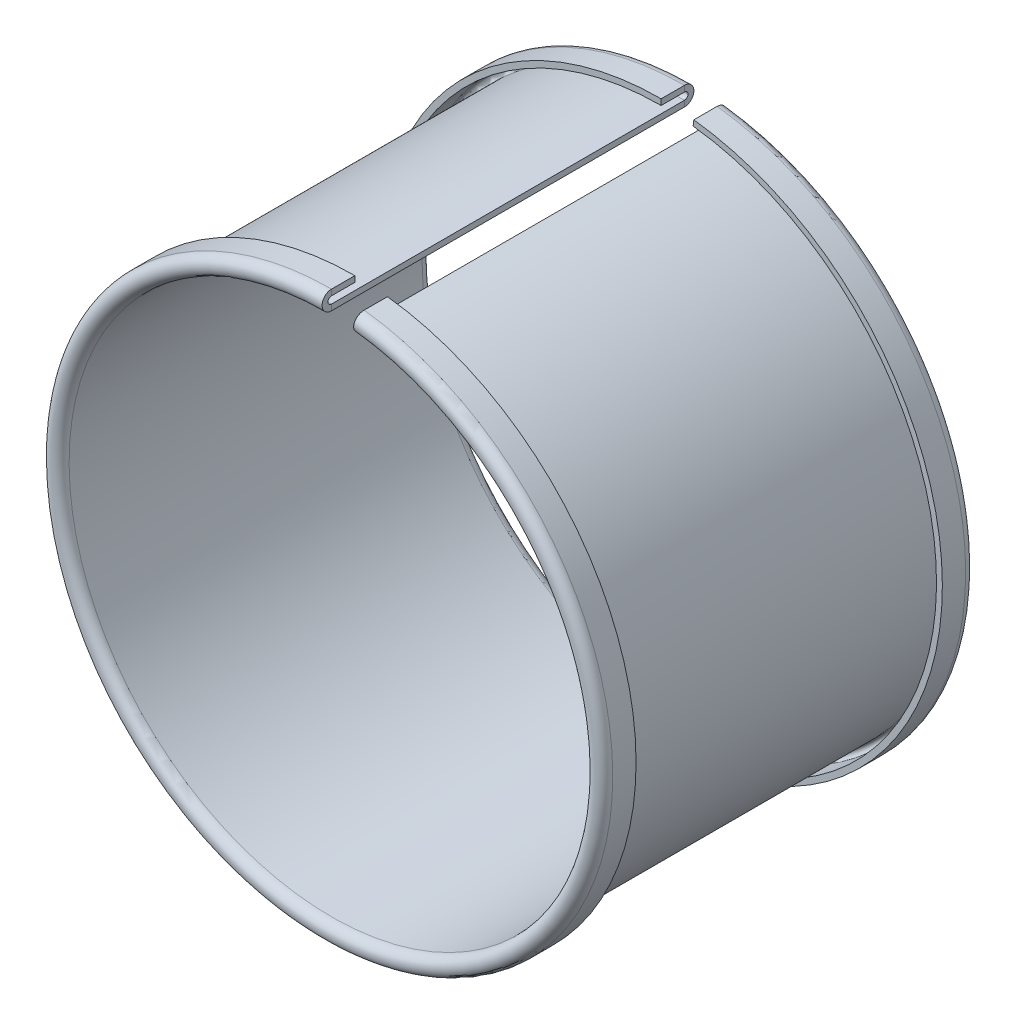
ISO-10303-21;
HEADER;
FILE_DESCRIPTION(('STEP AP214'),'2;1');
FILE_NAME('part.step','',(''),(''),'','','');
FILE_SCHEMA(('AUTOMOTIVE_DESIGN { 1 0 10303 214 1 1 1 1 }'));
ENDSEC;
DATA;
#1=APPLICATION_CONTEXT('core data for automotive mechanical design processes');
#2=APPLICATION_PROTOCOL_DEFINITION('international standard','automotive_design',2000,#1);
#3=PRODUCT_CONTEXT('',#1,'mechanical');
#4=PRODUCT('Part','Part','',(#3));
#5=PRODUCT_RELATED_PRODUCT_CATEGORY('part','',(#4));
#6=PRODUCT_DEFINITION_FORMATION('','',#4);
#7=PRODUCT_DEFINITION_CONTEXT('part definition',#1,'design');
#8=PRODUCT_DEFINITION('design','',#6,#7);
#9=PRODUCT_DEFINITION_SHAPE('','',#8);
#10=(LENGTH_UNIT() NAMED_UNIT(*) SI_UNIT(.MILLI.,.METRE.));
#11=(NAMED_UNIT(*) PLANE_ANGLE_UNIT() SI_UNIT($,.RADIAN.));
#12=(NAMED_UNIT(*) SI_UNIT($,.STERADIAN.) SOLID_ANGLE_UNIT());
#13=UNCERTAINTY_MEASURE_WITH_UNIT(LENGTH_MEASURE(1.E-05),#10,'distance_accuracy_value','');
#14=(GEOMETRIC_REPRESENTATION_CONTEXT(3) GLOBAL_UNCERTAINTY_ASSIGNED_CONTEXT((#13)) GLOBAL_UNIT_ASSIGNED_CONTEXT((#10,
#11,#12)) REPRESENTATION_CONTEXT('',''));
#15=CARTESIAN_POINT('',(0.,0.,0.));
#16=DIRECTION('',(0.,0.,1.));
#17=DIRECTION('',(1.,0.,0.));
#18=AXIS2_PLACEMENT_3D('',#15,#16,#17);
#19=CARTESIAN_POINT('',(5.40328216932433,46.229164912521,-60.4348691586507));
#20=DIRECTION('',(-0.993238685395127,0.116090110838776,0.));
#21=DIRECTION('',(-0.116090110838776,-0.993238685395127,0.));
#22=AXIS2_PLACEMENT_3D('',#19,#20,#21);
#23=PLANE('',#22);
#24=DIRECTION('',(-0.116090110838776,-0.993238685395127,0.));
#25=VECTOR('',#24,1.);
#26=CARTESIAN_POINT('',(5.59004213233672,47.8270376236985,-60.4348691586507));
#27=LINE('',#26,#25);
#28=CARTESIAN_POINT('',(5.59004213233672,47.8270376236985,-60.4348691586507));
#29=VERTEX_POINT('',#28);
#30=CARTESIAN_POINT('',(5.47395202149794,46.8337989383033,-60.4348691586507));
#31=VERTEX_POINT('',#30);
#32=EDGE_CURVE('E11',#29,#31,#27,.T.);
#33=ORIENTED_EDGE('',*,*,#32,.F.);
#34=CARTESIAN_POINT('',(5.40328216932433,46.229164912521,-60.4348691586507));
#35=DIRECTION('',(0.993238685395127,-0.116090110838776,0.));
#36=DIRECTION('',(0.,0.,-1.));
#37=AXIS2_PLACEMENT_3D('',#34,#35,#36);
#38=CIRCLE('',#37,1.60874997588503);
#39=CARTESIAN_POINT('',(5.21652220631197,44.6312922013435,-60.4348691586507));
#40=VERTEX_POINT('',#39);
#41=EDGE_CURVE('E160',#40,#29,#38,.T.);
#42=ORIENTED_EDGE('',*,*,#41,.F.);
#43=DIRECTION('',(0.116090110838777,0.993238685395127,0.));
#44=VECTOR('',#43,1.);
#45=CARTESIAN_POINT('',(5.21652220631197,44.6312922013435,-60.4348691586507));
#46=LINE('',#45,#44);
#47=CARTESIAN_POINT('',(5.33261231715075,45.6245308867386,-60.4348691586507));
#48=VERTEX_POINT('',#47);
#49=EDGE_CURVE('E49',#40,#48,#46,.T.);
#50=ORIENTED_EDGE('',*,*,#49,.T.);
#51=CARTESIAN_POINT('',(5.40328216932434,46.229164912521,-60.4348691586507));
#52=DIRECTION('',(0.993238685395127,-0.116090110838776,0.));
#53=DIRECTION('',(0.116090110838776,0.993238685395127,0.));
#54=AXIS2_PLACEMENT_3D('',#51,#52,#53);
#55=CIRCLE('',#54,0.608749975885032);
#56=EDGE_CURVE('E157',#48,#31,#55,.T.);
#57=ORIENTED_EDGE('',*,*,#56,.T.);
#58=EDGE_LOOP('',(#33,#42,#50,#57));
#59=FACE_BOUND('',#58,.T.);
#60=ADVANCED_FACE('F39',(#59),#23,.T.);
#61=CARTESIAN_POINT('',(5.21652220631196,44.6312922013435,-30.2174345793254));
#62=DIRECTION('',(0.993238685395127,-0.116090110838776,0.));
#63=DIRECTION('',(0.,0.,-1.));
#64=AXIS2_PLACEMENT_3D('',#61,#62,#63);
#65=PLANE('',#64);
#66=ORIENTED_EDGE('',*,*,#49,.F.);
#67=DIRECTION('',(0.,0.,-1.));
#68=VECTOR('',#67,1.);
#69=CARTESIAN_POINT('',(5.21652220631196,44.6312922013435,0.));
#70=LINE('',#69,#68);
#71=CARTESIAN_POINT('',(5.21652220631197,44.6312922013435,0.));
#72=VERTEX_POINT('',#71);
#73=EDGE_CURVE('E236',#72,#40,#70,.T.);
#74=ORIENTED_EDGE('',*,*,#73,.F.);
#75=DIRECTION('',(0.116090110838776,0.993238685395127,0.));
#76=VECTOR('',#75,1.);
#77=CARTESIAN_POINT('',(5.21652220631197,44.6312922013435,0.));
#78=LINE('',#77,#76);
#79=CARTESIAN_POINT('',(5.33261231715075,45.6245308867386,0.));
#80=VERTEX_POINT('',#79);
#81=EDGE_CURVE('E149',#72,#80,#78,.T.);
#82=ORIENTED_EDGE('',*,*,#81,.T.);
#83=DIRECTION('',(0.,0.,1.));
#84=VECTOR('',#83,1.);
#85=CARTESIAN_POINT('',(5.33261231715074,45.6245308867386,0.));
#86=LINE('',#85,#84);
#87=EDGE_CURVE('E177',#80,#48,#86,.F.);
#88=ORIENTED_EDGE('',*,*,#87,.T.);
#89=EDGE_LOOP('',(#66,#74,#82,#88));
#90=FACE_BOUND('',#89,.T.);
#91=ADVANCED_FACE('F178',(#90),#65,.F.);
#92=CARTESIAN_POINT('',(5.40328216932433,46.229164912521,0.));
#93=DIRECTION('',(-0.993238685395127,0.116090110838776,0.));
#94=DIRECTION('',(-0.116090110838776,-0.993238685395127,0.));
#95=AXIS2_PLACEMENT_3D('',#92,#93,#94);
#96=PLANE('',#95);
#97=ORIENTED_EDGE('',*,*,#81,.F.);
#98=CARTESIAN_POINT('',(5.40328216932433,46.229164912521,0.));
#99=DIRECTION('',(0.993238685395127,-0.116090110838776,0.));
#100=DIRECTION('',(0.,0.,1.));
#101=AXIS2_PLACEMENT_3D('',#98,#99,#100);
#102=CIRCLE('',#101,1.60874997588503);
#103=CARTESIAN_POINT('',(5.59004213233672,47.8270376236985,0.));
#104=VERTEX_POINT('',#103);
#105=EDGE_CURVE('E225',#104,#72,#102,.T.);
#106=ORIENTED_EDGE('',*,*,#105,.F.);
#107=DIRECTION('',(-0.116090110838777,-0.993238685395127,0.));
#108=VECTOR('',#107,1.);
#109=CARTESIAN_POINT('',(5.59004213233672,47.8270376236985,0.));
#110=LINE('',#109,#108);
#111=CARTESIAN_POINT('',(5.47395202149794,46.8337989383033,0.));
#112=VERTEX_POINT('',#111);
#113=EDGE_CURVE('E146',#104,#112,#110,.T.);
#114=ORIENTED_EDGE('',*,*,#113,.T.);
#115=CARTESIAN_POINT('',(5.40328216932434,46.229164912521,0.));
#116=DIRECTION('',(0.993238685395127,-0.116090110838776,0.));
#117=DIRECTION('',(0.116090110838776,0.993238685395127,0.));
#118=AXIS2_PLACEMENT_3D('',#115,#116,#117);
#119=CIRCLE('',#118,0.608749975885032);
#120=EDGE_CURVE('E194',#112,#80,#119,.T.);
#121=ORIENTED_EDGE('',*,*,#120,.T.);
#122=EDGE_LOOP('',(#97,#106,#114,#121));
#123=FACE_BOUND('',#122,.T.);
#124=ADVANCED_FACE('F268',(#123),#96,.T.);
#125=CARTESIAN_POINT('',(5.59004213233671,47.8270376236985,-1.99664372414659));
#126=DIRECTION('',(-0.993238685395127,0.116090110838776,0.));
#127=DIRECTION('',(0.,0.,1.));
#128=AXIS2_PLACEMENT_3D('',#125,#126,#127);
#129=PLANE('',#128);
#130=ORIENTED_EDGE('',*,*,#113,.F.);
#131=DIRECTION('',(0.,0.,1.));
#132=VECTOR('',#131,1.);
#133=CARTESIAN_POINT('',(5.59004213233671,47.8270376236985,0.));
#134=LINE('',#133,#132);
#135=CARTESIAN_POINT('',(5.59004213233672,47.8270376236985,-3.99328744829317));
#136=VERTEX_POINT('',#135);
#137=EDGE_CURVE('E219',#136,#104,#134,.T.);
#138=ORIENTED_EDGE('',*,*,#137,.F.);
#139=DIRECTION('',(-0.116090110838777,-0.993238685395127,0.));
#140=VECTOR('',#139,1.);
#141=CARTESIAN_POINT('',(5.59004213233672,47.8270376236985,-3.99328744829317));
#142=LINE('',#141,#140);
#143=CARTESIAN_POINT('',(5.47395202149794,46.8337989383033,-3.99328744829317));
#144=VERTEX_POINT('',#143);
#145=EDGE_CURVE('E143',#136,#144,#142,.T.);
#146=ORIENTED_EDGE('',*,*,#145,.T.);
#147=DIRECTION('',(0.,0.,1.));
#148=VECTOR('',#147,1.);
#149=CARTESIAN_POINT('',(5.47395202149793,46.8337989383033,0.));
#150=LINE('',#149,#148);
#151=EDGE_CURVE('E198',#144,#112,#150,.T.);
#152=ORIENTED_EDGE('',*,*,#151,.T.);
#153=EDGE_LOOP('',(#130,#138,#146,#152));
#154=FACE_BOUND('',#153,.T.);
#155=ADVANCED_FACE('F275',(#154),#129,.T.);
#156=CARTESIAN_POINT('',(0.,0.,-3.99328744829317));
#157=DIRECTION('',(0.,0.,-1.));
#158=DIRECTION('',(-1.,0.,0.));
#159=AXIS2_PLACEMENT_3D('',#156,#157,#158);
#160=PLANE('',#159);
#161=ORIENTED_EDGE('',*,*,#145,.F.);
#162=CARTESIAN_POINT('',(0.,0.,-3.99328744829317));
#163=DIRECTION('',(0.,0.,1.));
#164=DIRECTION('',(0.,1.,0.));
#165=AXIS2_PLACEMENT_3D('',#162,#163,#164);
#166=CIRCLE('',#165,48.152612586442);
#167=CARTESIAN_POINT('',(0.,48.152612586442,-3.99328744829317));
#168=VERTEX_POINT('',#167);
#169=EDGE_CURVE('E115',#168,#136,#166,.T.);
#170=ORIENTED_EDGE('',*,*,#169,.F.);
#171=DIRECTION('',(0.,-1.,0.));
#172=VECTOR('',#171,1.);
#173=CARTESIAN_POINT('',(0.,48.152612586442,-3.99328744829317));
#174=LINE('',#173,#172);
#175=CARTESIAN_POINT('',(0.,47.152612586442,-3.99328744829317));
#176=VERTEX_POINT('',#175);
#177=EDGE_CURVE('E140',#168,#176,#174,.T.);
#178=ORIENTED_EDGE('',*,*,#177,.T.);
#179=CARTESIAN_POINT('',(0.,0.,-3.99328744829317));
#180=DIRECTION('',(0.,0.,1.));
#181=DIRECTION('',(1.,0.,0.));
#182=AXIS2_PLACEMENT_3D('',#179,#180,#181);
#183=CIRCLE('',#182,47.152612586442);
#184=EDGE_CURVE('E203',#176,#144,#183,.T.);
#185=ORIENTED_EDGE('',*,*,#184,.T.);
#186=EDGE_LOOP('',(#161,#170,#178,#185));
#187=FACE_BOUND('',#186,.T.);
#188=ADVANCED_FACE('F300',(#187),#160,.T.);
#189=CARTESIAN_POINT('',(0.,48.152612586442,-1.99664372414659));
#190=DIRECTION('',(-1.,0.,0.));
#191=DIRECTION('',(0.,0.,1.));
#192=AXIS2_PLACEMENT_3D('',#189,#190,#191);
#193=PLANE('',#192);
#194=ORIENTED_EDGE('',*,*,#177,.F.);
#195=DIRECTION('',(0.,0.,1.));
#196=VECTOR('',#195,1.);
#197=CARTESIAN_POINT('',(0.,48.152612586442,0.));
#198=LINE('',#197,#196);
#199=CARTESIAN_POINT('',(0.,48.152612586442,0.));
#200=VERTEX_POINT('',#199);
#201=EDGE_CURVE('E215',#168,#200,#198,.T.);
#202=ORIENTED_EDGE('',*,*,#201,.T.);
#203=DIRECTION('',(0.,-1.,0.));
#204=VECTOR('',#203,1.);
#205=CARTESIAN_POINT('',(0.,48.152612586442,0.));
#206=LINE('',#205,#204);
#207=CARTESIAN_POINT('',(0.,47.152612586442,0.));
#208=VERTEX_POINT('',#207);
#209=EDGE_CURVE('E137',#200,#208,#206,.T.);
#210=ORIENTED_EDGE('',*,*,#209,.T.);
#211=DIRECTION('',(0.,0.,1.));
#212=VECTOR('',#211,1.);
#213=CARTESIAN_POINT('',(0.,47.152612586442,0.));
#214=LINE('',#213,#212);
#215=EDGE_CURVE('E122',#176,#208,#214,.T.);
#216=ORIENTED_EDGE('',*,*,#215,.F.);
#217=EDGE_LOOP('',(#194,#202,#210,#216));
#218=FACE_BOUND('',#217,.T.);
#219=ADVANCED_FACE('F302',(#218),#193,.F.);
#220=CARTESIAN_POINT('',(0.,46.5438626105569,0.));
#221=DIRECTION('',(-1.,0.,0.));
#222=DIRECTION('',(0.,0.,1.));
#223=AXIS2_PLACEMENT_3D('',#220,#221,#222);
#224=PLANE('',#223);
#225=ORIENTED_EDGE('',*,*,#209,.F.);
#226=CARTESIAN_POINT('',(0.,46.5438626105569,0.));
#227=DIRECTION('',(1.,0.,0.));
#228=DIRECTION('',(0.,0.,1.));
#229=AXIS2_PLACEMENT_3D('',#226,#227,#228);
#230=CIRCLE('',#229,1.60874997588503);
#231=CARTESIAN_POINT('',(0.,44.9351126346719,0.));
#232=VERTEX_POINT('',#231);
#233=EDGE_CURVE('E218',#200,#232,#230,.T.);
#234=ORIENTED_EDGE('',*,*,#233,.T.);
#235=DIRECTION('',(0.,1.,0.));
#236=VECTOR('',#235,1.);
#237=CARTESIAN_POINT('',(0.,44.9351126346719,0.));
#238=LINE('',#237,#236);
#239=CARTESIAN_POINT('',(0.,45.9351126346719,0.));
#240=VERTEX_POINT('',#239);
#241=EDGE_CURVE('E134',#232,#240,#238,.T.);
#242=ORIENTED_EDGE('',*,*,#241,.T.);
#243=CARTESIAN_POINT('',(0.,46.5438626105569,0.));
#244=DIRECTION('',(1.,0.,0.));
#245=DIRECTION('',(0.,1.,0.));
#246=AXIS2_PLACEMENT_3D('',#243,#244,#245);
#247=CIRCLE('',#246,0.608749975885032);
#248=EDGE_CURVE('E125',#208,#240,#247,.T.);
#249=ORIENTED_EDGE('',*,*,#248,.F.);
#250=EDGE_LOOP('',(#225,#234,#242,#249));
#251=FACE_BOUND('',#250,.T.);
#252=ADVANCED_FACE('F282',(#251),#224,.F.);
#253=CARTESIAN_POINT('',(0.,44.9351126346719,-30.2174345793254));
#254=DIRECTION('',(1.,0.,0.));
#255=DIRECTION('',(0.,0.,-1.));
#256=AXIS2_PLACEMENT_3D('',#253,#254,#255);
#257=PLANE('',#256);
#258=ORIENTED_EDGE('',*,*,#241,.F.);
#259=DIRECTION('',(0.,0.,-1.));
#260=VECTOR('',#259,1.);
#261=CARTESIAN_POINT('',(0.,44.9351126346719,0.));
#262=LINE('',#261,#260);
#263=CARTESIAN_POINT('',(0.,44.9351126346719,-60.4348691586507));
#264=VERTEX_POINT('',#263);
#265=EDGE_CURVE('E230',#232,#264,#262,.T.);
#266=ORIENTED_EDGE('',*,*,#265,.T.);
#267=DIRECTION('',(0.,1.,0.));
#268=VECTOR('',#267,1.);
#269=CARTESIAN_POINT('',(0.,44.9351126346719,-60.4348691586507));
#270=LINE('',#269,#268);
#271=CARTESIAN_POINT('',(0.,45.9351126346719,-60.4348691586507));
#272=VERTEX_POINT('',#271);
#273=EDGE_CURVE('E131',#264,#272,#270,.T.);
#274=ORIENTED_EDGE('',*,*,#273,.T.);
#275=DIRECTION('',(0.,0.,1.));
#276=VECTOR('',#275,1.);
#277=CARTESIAN_POINT('',(0.,45.9351126346719,0.));
#278=LINE('',#277,#276);
#279=EDGE_CURVE('E187',#240,#272,#278,.F.);
#280=ORIENTED_EDGE('',*,*,#279,.F.);
#281=EDGE_LOOP('',(#258,#266,#274,#280));
#282=FACE_BOUND('',#281,.T.);
#283=ADVANCED_FACE('F285',(#282),#257,.T.);
#284=CARTESIAN_POINT('',(0.,46.5438626105569,-60.4348691586507));
#285=DIRECTION('',(-1.,0.,0.));
#286=DIRECTION('',(0.,0.,1.));
#287=AXIS2_PLACEMENT_3D('',#284,#285,#286);
#288=PLANE('',#287);
#289=ORIENTED_EDGE('',*,*,#273,.F.);
#290=CARTESIAN_POINT('',(0.,46.5438626105569,-60.4348691586507));
#291=DIRECTION('',(1.,0.,0.));
#292=DIRECTION('',(0.,0.,-1.));
#293=AXIS2_PLACEMENT_3D('',#290,#291,#292);
#294=CIRCLE('',#293,1.60874997588503);
#295=CARTESIAN_POINT('',(0.,48.152612586442,-60.4348691586507));
#296=VERTEX_POINT('',#295);
#297=EDGE_CURVE('E116',#264,#296,#294,.T.);
#298=ORIENTED_EDGE('',*,*,#297,.T.);
#299=DIRECTION('',(0.,-1.,0.));
#300=VECTOR('',#299,1.);
#301=CARTESIAN_POINT('',(0.,48.152612586442,-60.4348691586507));
#302=LINE('',#301,#300);
#303=CARTESIAN_POINT('',(0.,47.152612586442,-60.4348691586507));
#304=VERTEX_POINT('',#303);
#305=EDGE_CURVE('E105',#296,#304,#302,.T.);
#306=ORIENTED_EDGE('',*,*,#305,.T.);
#307=CARTESIAN_POINT('',(0.,46.5438626105569,-60.4348691586507));
#308=DIRECTION('',(1.,0.,0.));
#309=DIRECTION('',(0.,1.,0.));
#310=AXIS2_PLACEMENT_3D('',#307,#308,#309);
#311=CIRCLE('',#310,0.608749975885032);
#312=EDGE_CURVE('E204',#272,#304,#311,.T.);
#313=ORIENTED_EDGE('',*,*,#312,.F.);
#314=EDGE_LOOP('',(#289,#298,#306,#313));
#315=FACE_BOUND('',#314,.T.);
#316=ADVANCED_FACE('F291',(#315),#288,.F.);
#317=CARTESIAN_POINT('',(0.,48.152612586442,-58.4382254345042));
#318=DIRECTION('',(-1.,0.,0.));
#319=DIRECTION('',(0.,0.,1.));
#320=AXIS2_PLACEMENT_3D('',#317,#318,#319);
#321=PLANE('',#320);
#322=ORIENTED_EDGE('',*,*,#305,.F.);
#323=DIRECTION('',(0.,0.,1.));
#324=VECTOR('',#323,1.);
#325=CARTESIAN_POINT('',(0.,48.152612586442,-60.4348691586507));
#326=LINE('',#325,#324);
#327=CARTESIAN_POINT('',(0.,48.152612586442,-56.4415817103576));
#328=VERTEX_POINT('',#327);
#329=EDGE_CURVE('E108',#296,#328,#326,.T.);
#330=ORIENTED_EDGE('',*,*,#329,.T.);
#331=DIRECTION('',(0.,-1.,0.));
#332=VECTOR('',#331,1.);
#333=CARTESIAN_POINT('',(0.,48.152612586442,-56.4415817103576));
#334=LINE('',#333,#332);
#335=CARTESIAN_POINT('',(0.,47.152612586442,-56.4415817103576));
#336=VERTEX_POINT('',#335);
#337=EDGE_CURVE('E94',#328,#336,#334,.T.);
#338=ORIENTED_EDGE('',*,*,#337,.T.);
#339=DIRECTION('',(0.,0.,1.));
#340=VECTOR('',#339,1.);
#341=CARTESIAN_POINT('',(0.,47.152612586442,0.));
#342=LINE('',#341,#340);
#343=EDGE_CURVE('E201',#304,#336,#342,.T.);
#344=ORIENTED_EDGE('',*,*,#343,.F.);
#345=EDGE_LOOP('',(#322,#330,#338,#344));
#346=FACE_BOUND('',#345,.T.);
#347=ADVANCED_FACE('F109',(#346),#321,.F.);
#348=CARTESIAN_POINT('',(0.,0.,-56.4415817103576));
#349=DIRECTION('',(0.,0.,-1.));
#350=DIRECTION('',(-1.,0.,0.));
#351=AXIS2_PLACEMENT_3D('',#348,#349,#350);
#352=PLANE('',#351);
#353=ORIENTED_EDGE('',*,*,#337,.F.);
#354=CARTESIAN_POINT('',(0.,0.,-56.4415817103576));
#355=DIRECTION('',(0.,0.,1.));
#356=DIRECTION('',(0.,1.,0.));
#357=AXIS2_PLACEMENT_3D('',#354,#355,#356);
#358=CIRCLE('',#357,48.152612586442);
#359=CARTESIAN_POINT('',(5.59004213233672,47.8270376236985,-56.4415817103576));
#360=VERTEX_POINT('',#359);
#361=EDGE_CURVE('E98',#328,#360,#358,.T.);
#362=ORIENTED_EDGE('',*,*,#361,.T.);
#363=DIRECTION('',(-0.116090110838777,-0.993238685395127,0.));
#364=VECTOR('',#363,1.);
#365=CARTESIAN_POINT('',(5.59004213233672,47.8270376236985,-56.4415817103576));
#366=LINE('',#365,#364);
#367=CARTESIAN_POINT('',(5.47395202149794,46.8337989383033,-56.4415817103576));
#368=VERTEX_POINT('',#367);
#369=EDGE_CURVE('E43',#360,#368,#366,.T.);
#370=ORIENTED_EDGE('',*,*,#369,.T.);
#371=CARTESIAN_POINT('',(0.,0.,-56.4415817103576));
#372=DIRECTION('',(0.,0.,1.));
#373=DIRECTION('',(1.,0.,0.));
#374=AXIS2_PLACEMENT_3D('',#371,#372,#373);
#375=CIRCLE('',#374,47.152612586442);
#376=EDGE_CURVE('E101',#336,#368,#375,.T.);
#377=ORIENTED_EDGE('',*,*,#376,.F.);
#378=EDGE_LOOP('',(#353,#362,#370,#377));
#379=FACE_BOUND('',#378,.T.);
#380=ADVANCED_FACE('F96',(#379),#352,.F.);
#381=CARTESIAN_POINT('',(5.59004213233671,47.8270376236985,-58.4382254345042));
#382=DIRECTION('',(-0.993238685395127,0.116090110838776,0.));
#383=DIRECTION('',(0.,0.,1.));
#384=AXIS2_PLACEMENT_3D('',#381,#382,#383);
#385=PLANE('',#384);
#386=DIRECTION('',(0.,0.,1.));
#387=VECTOR('',#386,1.);
#388=CARTESIAN_POINT('',(5.59004213233671,47.8270376236985,-60.4348691586507));
#389=LINE('',#388,#387);
#390=EDGE_CURVE('E121',#29,#360,#389,.T.);
#391=ORIENTED_EDGE('',*,*,#390,.F.);
#392=ORIENTED_EDGE('',*,*,#32,.T.);
#393=DIRECTION('',(0.,0.,1.));
#394=VECTOR('',#393,1.);
#395=CARTESIAN_POINT('',(5.47395202149793,46.8337989383033,0.));
#396=LINE('',#395,#394);
#397=EDGE_CURVE('E200',#31,#368,#396,.T.);
#398=ORIENTED_EDGE('',*,*,#397,.T.);
#399=ORIENTED_EDGE('',*,*,#369,.F.);
#400=EDGE_LOOP('',(#391,#392,#398,#399));
#401=FACE_BOUND('',#400,.T.);
#402=ADVANCED_FACE('F41',(#401),#385,.T.);
#403=CARTESIAN_POINT('',(0.,0.,0.));
#404=DIRECTION('',(0.,0.,1.));
#405=DIRECTION('',(1.,0.,0.));
#406=AXIS2_PLACEMENT_3D('',#403,#404,#405);
#407=CYLINDRICAL_SURFACE('',#406,47.152612586442);
#408=ORIENTED_EDGE('',*,*,#376,.T.);
#409=ORIENTED_EDGE('',*,*,#397,.F.);
#410=CARTESIAN_POINT('',(0.,0.,-60.4348691586507));
#411=DIRECTION('',(0.,0.,1.));
#412=DIRECTION('',(1.,0.,0.));
#413=AXIS2_PLACEMENT_3D('',#410,#411,#412);
#414=CIRCLE('',#413,47.152612586442);
#415=EDGE_CURVE('E174',#304,#31,#414,.T.);
#416=ORIENTED_EDGE('',*,*,#415,.F.);
#417=ORIENTED_EDGE('',*,*,#343,.T.);
#418=EDGE_LOOP('',(#408,#409,#416,#417));
#419=FACE_BOUND('',#418,.T.);
#420=ADVANCED_FACE('F392',(#419),#407,.F.);
#421=CARTESIAN_POINT('',(0.,0.,-60.4348691586507));
#422=DIRECTION('',(0.,0.,1.));
#423=DIRECTION('',(1.,0.,0.));
#424=AXIS2_PLACEMENT_3D('',#421,#422,#423);
#425=TOROIDAL_SURFACE('',#424,46.5438626105569,0.608749975885032);
#426=ORIENTED_EDGE('',*,*,#415,.T.);
#427=ORIENTED_EDGE('',*,*,#56,.F.);
#428=CARTESIAN_POINT('',(0.,0.,-60.4348691586507));
#429=DIRECTION('',(0.,0.,1.));
#430=DIRECTION('',(1.,0.,0.));
#431=AXIS2_PLACEMENT_3D('',#428,#429,#430);
#432=CIRCLE('',#431,45.9351126346719);
#433=EDGE_CURVE('E172',#272,#48,#432,.T.);
#434=ORIENTED_EDGE('',*,*,#433,.F.);
#435=ORIENTED_EDGE('',*,*,#312,.T.);
#436=EDGE_LOOP('',(#426,#427,#434,#435));
#437=FACE_BOUND('',#436,.T.);
#438=ADVANCED_FACE('F168',(#437),#425,.F.);
#439=CARTESIAN_POINT('',(0.,0.,0.));
#440=DIRECTION('',(0.,0.,1.));
#441=DIRECTION('',(1.,0.,0.));
#442=AXIS2_PLACEMENT_3D('',#439,#440,#441);
#443=CYLINDRICAL_SURFACE('',#442,45.9351126346719);
#444=ORIENTED_EDGE('',*,*,#433,.T.);
#445=ORIENTED_EDGE('',*,*,#87,.F.);
#446=CARTESIAN_POINT('',(0.,0.,0.));
#447=DIRECTION('',(0.,0.,1.));
#448=DIRECTION('',(1.,0.,0.));
#449=AXIS2_PLACEMENT_3D('',#446,#447,#448);
#450=CIRCLE('',#449,45.9351126346719);
#451=EDGE_CURVE('E182',#240,#80,#450,.T.);
#452=ORIENTED_EDGE('',*,*,#451,.F.);
#453=ORIENTED_EDGE('',*,*,#279,.T.);
#454=EDGE_LOOP('',(#444,#445,#452,#453));
#455=FACE_BOUND('',#454,.T.);
#456=ADVANCED_FACE('F185',(#455),#443,.T.);
#457=CARTESIAN_POINT('',(0.,0.,0.));
#458=DIRECTION('',(0.,0.,1.));
#459=DIRECTION('',(1.,0.,0.));
#460=AXIS2_PLACEMENT_3D('',#457,#458,#459);
#461=TOROIDAL_SURFACE('',#460,46.5438626105569,0.608749975885032);
#462=ORIENTED_EDGE('',*,*,#451,.T.);
#463=ORIENTED_EDGE('',*,*,#120,.F.);
#464=CARTESIAN_POINT('',(0.,0.,0.));
#465=DIRECTION('',(0.,0.,1.));
#466=DIRECTION('',(1.,0.,0.));
#467=AXIS2_PLACEMENT_3D('',#464,#465,#466);
#468=CIRCLE('',#467,47.152612586442);
#469=EDGE_CURVE('E195',#208,#112,#468,.T.);
#470=ORIENTED_EDGE('',*,*,#469,.F.);
#471=ORIENTED_EDGE('',*,*,#248,.T.);
#472=EDGE_LOOP('',(#462,#463,#470,#471));
#473=FACE_BOUND('',#472,.T.);
#474=ADVANCED_FACE('F273',(#473),#461,.F.);
#475=CARTESIAN_POINT('',(0.,0.,0.));
#476=DIRECTION('',(0.,0.,1.));
#477=DIRECTION('',(1.,0.,0.));
#478=AXIS2_PLACEMENT_3D('',#475,#476,#477);
#479=CYLINDRICAL_SURFACE('',#478,47.152612586442);
#480=ORIENTED_EDGE('',*,*,#469,.T.);
#481=ORIENTED_EDGE('',*,*,#151,.F.);
#482=ORIENTED_EDGE('',*,*,#184,.F.);
#483=ORIENTED_EDGE('',*,*,#215,.T.);
#484=EDGE_LOOP('',(#480,#481,#482,#483));
#485=FACE_BOUND('',#484,.T.);
#486=ADVANCED_FACE('F277',(#485),#479,.F.);
#487=CARTESIAN_POINT('',(0.,0.,0.));
#488=DIRECTION('',(0.,0.,1.));
#489=DIRECTION('',(1.,0.,0.));
#490=AXIS2_PLACEMENT_3D('',#487,#488,#489);
#491=CYLINDRICAL_SURFACE('',#490,48.152612586442);
#492=ORIENTED_EDGE('',*,*,#361,.F.);
#493=ORIENTED_EDGE('',*,*,#329,.F.);
#494=CARTESIAN_POINT('',(0.,0.,-60.4348691586507));
#495=DIRECTION('',(0.,0.,1.));
#496=DIRECTION('',(0.,1.,0.));
#497=AXIS2_PLACEMENT_3D('',#494,#495,#496);
#498=CIRCLE('',#497,48.152612586442);
#499=EDGE_CURVE('E127',#296,#29,#498,.T.);
#500=ORIENTED_EDGE('',*,*,#499,.T.);
#501=ORIENTED_EDGE('',*,*,#390,.T.);
#502=EDGE_LOOP('',(#492,#493,#500,#501));
#503=FACE_BOUND('',#502,.T.);
#504=ADVANCED_FACE('F119',(#503),#491,.T.);
#505=CARTESIAN_POINT('',(0.,0.,-60.4348691586507));
#506=DIRECTION('',(0.,0.,1.));
#507=DIRECTION('',(1.,0.,0.));
#508=AXIS2_PLACEMENT_3D('',#505,#506,#507);
#509=TOROIDAL_SURFACE('',#508,46.5438626105569,1.60874997588503);
#510=ORIENTED_EDGE('',*,*,#499,.F.);
#511=ORIENTED_EDGE('',*,*,#297,.F.);
#512=CARTESIAN_POINT('',(0.,0.,-60.4348691586507));
#513=DIRECTION('',(0.,0.,1.));
#514=DIRECTION('',(0.,1.,0.));
#515=AXIS2_PLACEMENT_3D('',#512,#513,#514);
#516=CIRCLE('',#515,44.9351126346719);
#517=EDGE_CURVE('E241',#264,#40,#516,.T.);
#518=ORIENTED_EDGE('',*,*,#517,.T.);
#519=ORIENTED_EDGE('',*,*,#41,.T.);
#520=EDGE_LOOP('',(#510,#511,#518,#519));
#521=FACE_BOUND('',#520,.T.);
#522=ADVANCED_FACE('F247',(#521),#509,.T.);
#523=CARTESIAN_POINT('',(0.,0.,0.));
#524=DIRECTION('',(0.,0.,1.));
#525=DIRECTION('',(1.,0.,0.));
#526=AXIS2_PLACEMENT_3D('',#523,#524,#525);
#527=CYLINDRICAL_SURFACE('',#526,44.9351126346719);
#528=ORIENTED_EDGE('',*,*,#517,.F.);
#529=ORIENTED_EDGE('',*,*,#265,.F.);
#530=CARTESIAN_POINT('',(0.,0.,0.));
#531=DIRECTION('',(0.,0.,1.));
#532=DIRECTION('',(0.,1.,0.));
#533=AXIS2_PLACEMENT_3D('',#530,#531,#532);
#534=CIRCLE('',#533,44.9351126346719);
#535=EDGE_CURVE('E233',#232,#72,#534,.T.);
#536=ORIENTED_EDGE('',*,*,#535,.T.);
#537=ORIENTED_EDGE('',*,*,#73,.T.);
#538=EDGE_LOOP('',(#528,#529,#536,#537));
#539=FACE_BOUND('',#538,.T.);
#540=ADVANCED_FACE('F293',(#539),#527,.F.);
#541=CARTESIAN_POINT('',(0.,0.,0.));
#542=DIRECTION('',(0.,0.,1.));
#543=DIRECTION('',(1.,0.,0.));
#544=AXIS2_PLACEMENT_3D('',#541,#542,#543);
#545=TOROIDAL_SURFACE('',#544,46.5438626105569,1.60874997588503);
#546=ORIENTED_EDGE('',*,*,#535,.F.);
#547=ORIENTED_EDGE('',*,*,#233,.F.);
#548=CARTESIAN_POINT('',(0.,0.,0.));
#549=DIRECTION('',(0.,0.,1.));
#550=DIRECTION('',(0.,1.,0.));
#551=AXIS2_PLACEMENT_3D('',#548,#549,#550);
#552=CIRCLE('',#551,48.152612586442);
#553=EDGE_CURVE('E222',#200,#104,#552,.T.);
#554=ORIENTED_EDGE('',*,*,#553,.T.);
#555=ORIENTED_EDGE('',*,*,#105,.T.);
#556=EDGE_LOOP('',(#546,#547,#554,#555));
#557=FACE_BOUND('',#556,.T.);
#558=ADVANCED_FACE('F296',(#557),#545,.T.);
#559=CARTESIAN_POINT('',(0.,0.,0.));
#560=DIRECTION('',(0.,0.,1.));
#561=DIRECTION('',(1.,0.,0.));
#562=AXIS2_PLACEMENT_3D('',#559,#560,#561);
#563=CYLINDRICAL_SURFACE('',#562,48.152612586442);
#564=ORIENTED_EDGE('',*,*,#553,.F.);
#565=ORIENTED_EDGE('',*,*,#201,.F.);
#566=ORIENTED_EDGE('',*,*,#169,.T.);
#567=ORIENTED_EDGE('',*,*,#137,.T.);
#568=EDGE_LOOP('',(#564,#565,#566,#567));
#569=FACE_BOUND('',#568,.T.);
#570=ADVANCED_FACE('F299',(#569),#563,.T.);
#571=CLOSED_SHELL('',(#60,#91,#124,#155,#188,#219,#252,#283,#316,#347,#380,#402,#420,#438,#456,
#474,#486,#504,#522,#540,#558,#570));
#572=MANIFOLD_SOLID_BREP('B2',#571);
#573=ADVANCED_BREP_SHAPE_REPRESENTATION('',(#18,#572),#14);
#574=SHAPE_DEFINITION_REPRESENTATION(#9,#573);
ENDSEC;
END-ISO-10303-21;
